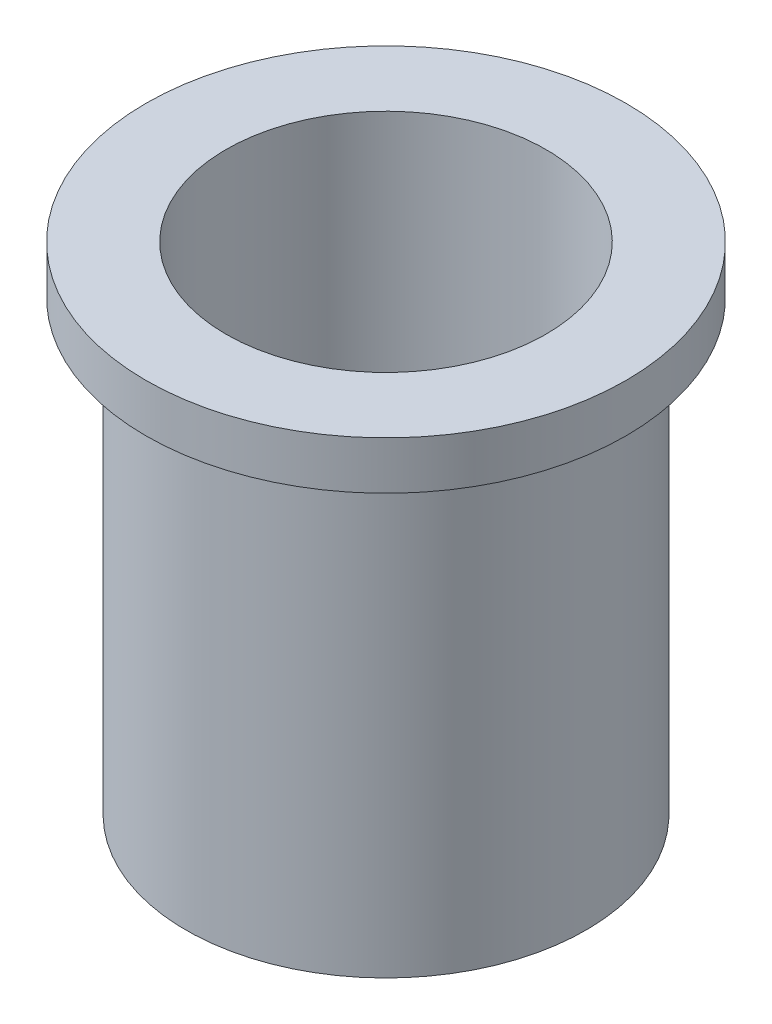
ISO-10303-21;
HEADER;
FILE_DESCRIPTION(('STEP AP214'),'2;1');
FILE_NAME('part.step','',(''),(''),'','','');
FILE_SCHEMA(('AUTOMOTIVE_DESIGN { 1 0 10303 214 1 1 1 1 }'));
ENDSEC;
DATA;
#1=APPLICATION_CONTEXT('core data for automotive mechanical design processes');
#2=APPLICATION_PROTOCOL_DEFINITION('international standard','automotive_design',2000,#1);
#3=PRODUCT_CONTEXT('',#1,'mechanical');
#4=PRODUCT('Part','Part','',(#3));
#5=PRODUCT_RELATED_PRODUCT_CATEGORY('part','',(#4));
#6=PRODUCT_DEFINITION_FORMATION('','',#4);
#7=PRODUCT_DEFINITION_CONTEXT('part definition',#1,'design');
#8=PRODUCT_DEFINITION('design','',#6,#7);
#9=PRODUCT_DEFINITION_SHAPE('','',#8);
#10=(LENGTH_UNIT() NAMED_UNIT(*) SI_UNIT(.MILLI.,.METRE.));
#11=(NAMED_UNIT(*) PLANE_ANGLE_UNIT() SI_UNIT($,.RADIAN.));
#12=(NAMED_UNIT(*) SI_UNIT($,.STERADIAN.) SOLID_ANGLE_UNIT());
#13=UNCERTAINTY_MEASURE_WITH_UNIT(LENGTH_MEASURE(1.E-05),#10,'distance_accuracy_value','');
#14=(GEOMETRIC_REPRESENTATION_CONTEXT(3) GLOBAL_UNCERTAINTY_ASSIGNED_CONTEXT((#13)) GLOBAL_UNIT_ASSIGNED_CONTEXT((#10,
#11,#12)) REPRESENTATION_CONTEXT('',''));
#15=CARTESIAN_POINT('',(0.,0.,0.));
#16=DIRECTION('',(0.,0.,1.));
#17=DIRECTION('',(1.,0.,0.));
#18=AXIS2_PLACEMENT_3D('',#15,#16,#17);
#19=CARTESIAN_POINT('',(0.,1.5,0.));
#20=DIRECTION('',(0.,-1.,0.));
#21=DIRECTION('',(0.,0.,-1.));
#22=AXIS2_PLACEMENT_3D('',#19,#20,#21);
#23=CYLINDRICAL_SURFACE('',#22,15.);
#24=CARTESIAN_POINT('',(0.,1.5,0.));
#25=DIRECTION('',(0.,1.,0.));
#26=DIRECTION('',(0.,0.,1.));
#27=AXIS2_PLACEMENT_3D('',#24,#25,#26);
#28=CIRCLE('',#27,15.);
#29=CARTESIAN_POINT('',(0.,1.5,15.));
#30=VERTEX_POINT('',#29);
#31=EDGE_CURVE('E49',#30,#30,#28,.T.);
#32=ORIENTED_EDGE('',*,*,#31,.F.);
#33=EDGE_LOOP('',(#32));
#34=FACE_BOUND('',#33,.T.);
#35=CARTESIAN_POINT('',(0.,-1.5,0.));
#36=DIRECTION('',(0.,1.,0.));
#37=DIRECTION('',(0.,0.,1.));
#38=AXIS2_PLACEMENT_3D('',#35,#36,#37);
#39=CIRCLE('',#38,15.);
#40=CARTESIAN_POINT('',(0.,-1.5,15.));
#41=VERTEX_POINT('',#40);
#42=EDGE_CURVE('E44',#41,#41,#39,.T.);
#43=ORIENTED_EDGE('',*,*,#42,.T.);
#44=EDGE_LOOP('',(#43));
#45=FACE_BOUND('',#44,.T.);
#46=ADVANCED_FACE('F41',(#34,#45),#23,.T.);
#47=CARTESIAN_POINT('',(0.,1.5,0.));
#48=DIRECTION('',(0.,1.,0.));
#49=DIRECTION('',(0.,0.,1.));
#50=AXIS2_PLACEMENT_3D('',#47,#48,#49);
#51=PLANE('',#50);
#52=CARTESIAN_POINT('',(0.,1.5,0.));
#53=DIRECTION('',(0.,1.,0.));
#54=DIRECTION('',(0.,0.,1.));
#55=AXIS2_PLACEMENT_3D('',#52,#53,#54);
#56=CIRCLE('',#55,10.);
#57=CARTESIAN_POINT('',(0.,1.5,10.));
#58=VERTEX_POINT('',#57);
#59=EDGE_CURVE('E61',#58,#58,#56,.T.);
#60=ORIENTED_EDGE('',*,*,#59,.F.);
#61=EDGE_LOOP('',(#60));
#62=FACE_BOUND('',#61,.T.);
#63=ORIENTED_EDGE('',*,*,#31,.T.);
#64=EDGE_LOOP('',(#63));
#65=FACE_BOUND('',#64,.T.);
#66=ADVANCED_FACE('F78',(#62,#65),#51,.T.);
#67=CARTESIAN_POINT('',(0.,-1.5,0.));
#68=DIRECTION('',(0.,1.,0.));
#69=DIRECTION('',(0.,0.,1.));
#70=AXIS2_PLACEMENT_3D('',#67,#68,#69);
#71=PLANE('',#70);
#72=CARTESIAN_POINT('',(0.,-1.5,0.));
#73=DIRECTION('',(0.,-1.,0.));
#74=DIRECTION('',(0.,0.,-1.));
#75=AXIS2_PLACEMENT_3D('',#72,#73,#74);
#76=CIRCLE('',#75,12.5);
#77=CARTESIAN_POINT('',(0.,-1.5,-12.5));
#78=VERTEX_POINT('',#77);
#79=EDGE_CURVE('E10',#78,#78,#76,.T.);
#80=ORIENTED_EDGE('',*,*,#79,.F.);
#81=EDGE_LOOP('',(#80));
#82=FACE_BOUND('',#81,.T.);
#83=ORIENTED_EDGE('',*,*,#42,.F.);
#84=EDGE_LOOP('',(#83));
#85=FACE_BOUND('',#84,.T.);
#86=ADVANCED_FACE('F81',(#82,#85),#71,.F.);
#87=CARTESIAN_POINT('',(0.,-29.5,0.));
#88=DIRECTION('',(0.,1.,0.));
#89=DIRECTION('',(0.,0.,1.));
#90=AXIS2_PLACEMENT_3D('',#87,#88,#89);
#91=CYLINDRICAL_SURFACE('',#90,12.5);
#92=CARTESIAN_POINT('',(0.,-29.5,0.));
#93=DIRECTION('',(0.,-1.,0.));
#94=DIRECTION('',(0.,0.,-1.));
#95=AXIS2_PLACEMENT_3D('',#92,#93,#94);
#96=CIRCLE('',#95,12.5);
#97=CARTESIAN_POINT('',(0.,-29.5,-12.5));
#98=VERTEX_POINT('',#97);
#99=EDGE_CURVE('E56',#98,#98,#96,.T.);
#100=ORIENTED_EDGE('',*,*,#99,.F.);
#101=EDGE_LOOP('',(#100));
#102=FACE_BOUND('',#101,.T.);
#103=ORIENTED_EDGE('',*,*,#79,.T.);
#104=EDGE_LOOP('',(#103));
#105=FACE_BOUND('',#104,.T.);
#106=ADVANCED_FACE('F92',(#102,#105),#91,.T.);
#107=CARTESIAN_POINT('',(0.,-29.5,0.));
#108=DIRECTION('',(0.,-1.,0.));
#109=DIRECTION('',(0.,0.,-1.));
#110=AXIS2_PLACEMENT_3D('',#107,#108,#109);
#111=PLANE('',#110);
#112=CARTESIAN_POINT('',(0.,-29.5,0.));
#113=DIRECTION('',(0.,1.,0.));
#114=DIRECTION('',(0.,0.,1.));
#115=AXIS2_PLACEMENT_3D('',#112,#113,#114);
#116=CIRCLE('',#115,10.);
#117=CARTESIAN_POINT('',(0.,-29.5,10.));
#118=VERTEX_POINT('',#117);
#119=EDGE_CURVE('E60',#118,#118,#116,.T.);
#120=ORIENTED_EDGE('',*,*,#119,.T.);
#121=EDGE_LOOP('',(#120));
#122=FACE_BOUND('',#121,.T.);
#123=ORIENTED_EDGE('',*,*,#99,.T.);
#124=EDGE_LOOP('',(#123));
#125=FACE_BOUND('',#124,.T.);
#126=ADVANCED_FACE('F69',(#122,#125),#111,.T.);
#127=CARTESIAN_POINT('',(0.,-29.5,0.));
#128=DIRECTION('',(0.,1.,0.));
#129=DIRECTION('',(0.,0.,1.));
#130=AXIS2_PLACEMENT_3D('',#127,#128,#129);
#131=CYLINDRICAL_SURFACE('',#130,10.);
#132=ORIENTED_EDGE('',*,*,#119,.F.);
#133=EDGE_LOOP('',(#132));
#134=FACE_BOUND('',#133,.T.);
#135=ORIENTED_EDGE('',*,*,#59,.T.);
#136=EDGE_LOOP('',(#135));
#137=FACE_BOUND('',#136,.T.);
#138=ADVANCED_FACE('F72',(#134,#137),#131,.F.);
#139=CLOSED_SHELL('',(#46,#66,#86,#106,#126,#138));
#140=MANIFOLD_SOLID_BREP('B2',#139);
#141=ADVANCED_BREP_SHAPE_REPRESENTATION('',(#18,#140),#14);
#142=SHAPE_DEFINITION_REPRESENTATION(#9,#141);
ENDSEC;
END-ISO-10303-21;
